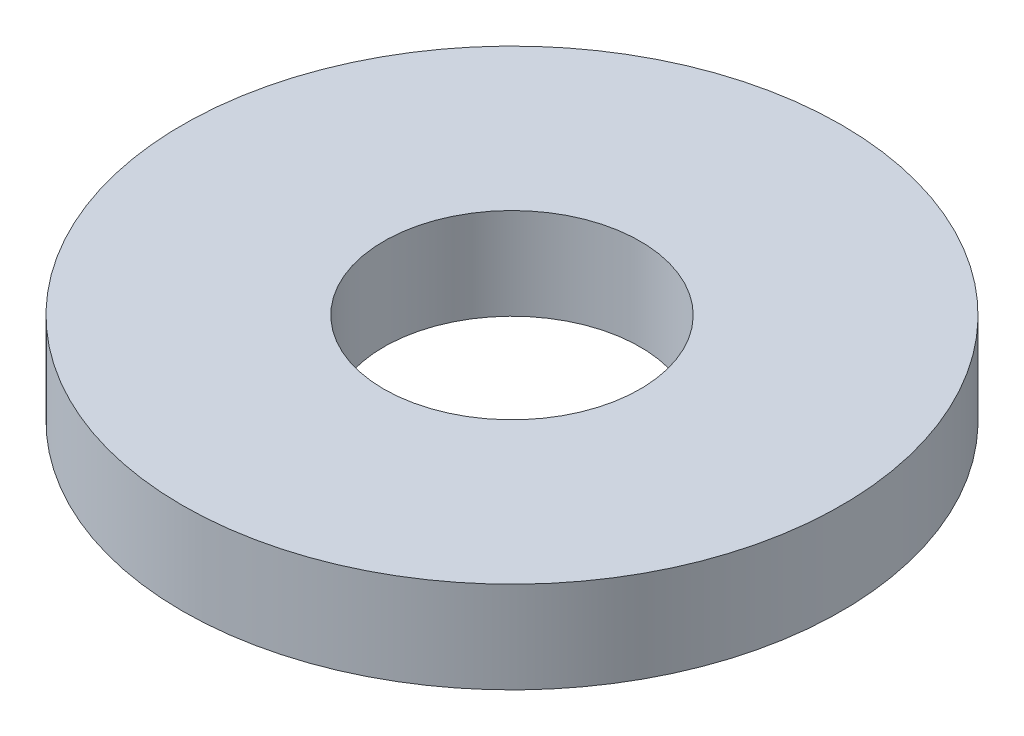
ISO-10303-21;
HEADER;
FILE_DESCRIPTION(('STEP AP214'),'2;1');
FILE_NAME('part.step','',(''),(''),'','','');
FILE_SCHEMA(('AUTOMOTIVE_DESIGN { 1 0 10303 214 1 1 1 1 }'));
ENDSEC;
DATA;
#1=APPLICATION_CONTEXT('core data for automotive mechanical design processes');
#2=APPLICATION_PROTOCOL_DEFINITION('international standard','automotive_design',2000,#1);
#3=PRODUCT_CONTEXT('',#1,'mechanical');
#4=PRODUCT('Part','Part','',(#3));
#5=PRODUCT_RELATED_PRODUCT_CATEGORY('part','',(#4));
#6=PRODUCT_DEFINITION_FORMATION('','',#4);
#7=PRODUCT_DEFINITION_CONTEXT('part definition',#1,'design');
#8=PRODUCT_DEFINITION('design','',#6,#7);
#9=PRODUCT_DEFINITION_SHAPE('','',#8);
#10=(LENGTH_UNIT() NAMED_UNIT(*) SI_UNIT(.MILLI.,.METRE.));
#11=(NAMED_UNIT(*) PLANE_ANGLE_UNIT() SI_UNIT($,.RADIAN.));
#12=(NAMED_UNIT(*) SI_UNIT($,.STERADIAN.) SOLID_ANGLE_UNIT());
#13=UNCERTAINTY_MEASURE_WITH_UNIT(LENGTH_MEASURE(1.E-05),#10,'distance_accuracy_value','');
#14=(GEOMETRIC_REPRESENTATION_CONTEXT(3) GLOBAL_UNCERTAINTY_ASSIGNED_CONTEXT((#13)) GLOBAL_UNIT_ASSIGNED_CONTEXT((#10,
#11,#12)) REPRESENTATION_CONTEXT('',''));
#15=CARTESIAN_POINT('',(0.,0.,0.));
#16=DIRECTION('',(0.,0.,1.));
#17=DIRECTION('',(1.,0.,0.));
#18=AXIS2_PLACEMENT_3D('',#15,#16,#17);
#19=CARTESIAN_POINT('',(0.,2.5,0.));
#20=DIRECTION('',(0.,1.,0.));
#21=DIRECTION('',(0.,0.,1.));
#22=AXIS2_PLACEMENT_3D('',#19,#20,#21);
#23=PLANE('',#22);
#24=CARTESIAN_POINT('',(0.,2.5,0.));
#25=DIRECTION('',(0.,1.,0.));
#26=DIRECTION('',(0.,0.,1.));
#27=AXIS2_PLACEMENT_3D('',#24,#25,#26);
#28=CIRCLE('',#27,9.);
#29=CARTESIAN_POINT('',(0.,2.5,9.));
#30=VERTEX_POINT('',#29);
#31=EDGE_CURVE('E10',#30,#30,#28,.T.);
#32=ORIENTED_EDGE('',*,*,#31,.T.);
#33=EDGE_LOOP('',(#32));
#34=FACE_BOUND('',#33,.T.);
#35=CARTESIAN_POINT('',(0.,2.5,0.));
#36=DIRECTION('',(0.,1.,0.));
#37=DIRECTION('',(0.,0.,1.));
#38=AXIS2_PLACEMENT_3D('',#35,#36,#37);
#39=CIRCLE('',#38,3.5);
#40=CARTESIAN_POINT('',(0.,2.5,3.5));
#41=VERTEX_POINT('',#40);
#42=EDGE_CURVE('E45',#41,#41,#39,.T.);
#43=ORIENTED_EDGE('',*,*,#42,.F.);
#44=EDGE_LOOP('',(#43));
#45=FACE_BOUND('',#44,.T.);
#46=ADVANCED_FACE('F34',(#34,#45),#23,.T.);
#47=CARTESIAN_POINT('',(0.,0.,0.));
#48=DIRECTION('',(0.,1.,0.));
#49=DIRECTION('',(0.,0.,1.));
#50=AXIS2_PLACEMENT_3D('',#47,#48,#49);
#51=PLANE('',#50);
#52=CARTESIAN_POINT('',(0.,0.,0.));
#53=DIRECTION('',(0.,1.,0.));
#54=DIRECTION('',(0.,0.,1.));
#55=AXIS2_PLACEMENT_3D('',#52,#53,#54);
#56=CIRCLE('',#55,9.);
#57=CARTESIAN_POINT('',(0.,0.,9.));
#58=VERTEX_POINT('',#57);
#59=EDGE_CURVE('E38',#58,#58,#56,.T.);
#60=ORIENTED_EDGE('',*,*,#59,.F.);
#61=EDGE_LOOP('',(#60));
#62=FACE_BOUND('',#61,.T.);
#63=CARTESIAN_POINT('',(0.,0.,0.));
#64=DIRECTION('',(0.,1.,0.));
#65=DIRECTION('',(0.,0.,1.));
#66=AXIS2_PLACEMENT_3D('',#63,#64,#65);
#67=CIRCLE('',#66,3.5);
#68=CARTESIAN_POINT('',(0.,0.,3.5));
#69=VERTEX_POINT('',#68);
#70=EDGE_CURVE('E47',#69,#69,#67,.T.);
#71=ORIENTED_EDGE('',*,*,#70,.T.);
#72=EDGE_LOOP('',(#71));
#73=FACE_BOUND('',#72,.T.);
#74=ADVANCED_FACE('F57',(#62,#73),#51,.F.);
#75=CARTESIAN_POINT('',(0.,2.5,0.));
#76=DIRECTION('',(0.,-1.,0.));
#77=DIRECTION('',(0.,0.,-1.));
#78=AXIS2_PLACEMENT_3D('',#75,#76,#77);
#79=CYLINDRICAL_SURFACE('',#78,9.);
#80=ORIENTED_EDGE('',*,*,#31,.F.);
#81=EDGE_LOOP('',(#80));
#82=FACE_BOUND('',#81,.T.);
#83=ORIENTED_EDGE('',*,*,#59,.T.);
#84=EDGE_LOOP('',(#83));
#85=FACE_BOUND('',#84,.T.);
#86=ADVANCED_FACE('F36',(#82,#85),#79,.T.);
#87=CARTESIAN_POINT('',(0.,2.5,0.));
#88=DIRECTION('',(0.,-1.,0.));
#89=DIRECTION('',(0.,0.,-1.));
#90=AXIS2_PLACEMENT_3D('',#87,#88,#89);
#91=CYLINDRICAL_SURFACE('',#90,3.5);
#92=ORIENTED_EDGE('',*,*,#42,.T.);
#93=EDGE_LOOP('',(#92));
#94=FACE_BOUND('',#93,.T.);
#95=ORIENTED_EDGE('',*,*,#70,.F.);
#96=EDGE_LOOP('',(#95));
#97=FACE_BOUND('',#96,.T.);
#98=ADVANCED_FACE('F53',(#94,#97),#91,.F.);
#99=CLOSED_SHELL('',(#46,#74,#86,#98));
#100=MANIFOLD_SOLID_BREP('B2',#99);
#101=ADVANCED_BREP_SHAPE_REPRESENTATION('',(#18,#100),#14);
#102=SHAPE_DEFINITION_REPRESENTATION(#9,#101);
ENDSEC;
END-ISO-10303-21;
